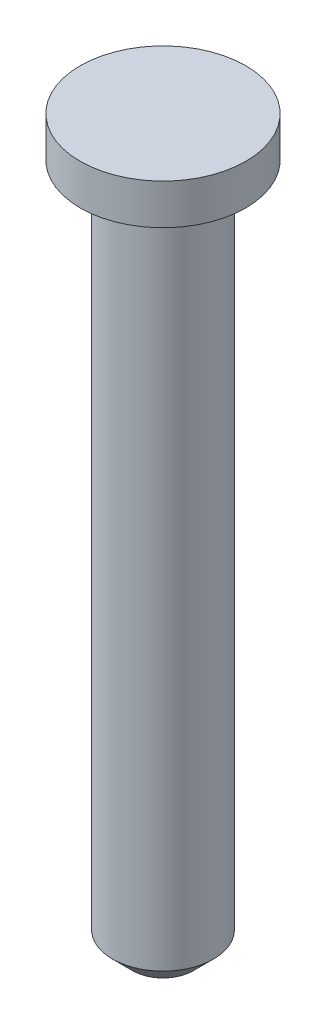
ISO-10303-21;
HEADER;
FILE_DESCRIPTION(('STEP AP214'),'2;1');
FILE_NAME('part.step','',(''),(''),'','','');
FILE_SCHEMA(('AUTOMOTIVE_DESIGN { 1 0 10303 214 1 1 1 1 }'));
ENDSEC;
DATA;
#1=APPLICATION_CONTEXT('core data for automotive mechanical design processes');
#2=APPLICATION_PROTOCOL_DEFINITION('international standard','automotive_design',2000,#1);
#3=PRODUCT_CONTEXT('',#1,'mechanical');
#4=PRODUCT('Part','Part','',(#3));
#5=PRODUCT_RELATED_PRODUCT_CATEGORY('part','',(#4));
#6=PRODUCT_DEFINITION_FORMATION('','',#4);
#7=PRODUCT_DEFINITION_CONTEXT('part definition',#1,'design');
#8=PRODUCT_DEFINITION('design','',#6,#7);
#9=PRODUCT_DEFINITION_SHAPE('','',#8);
#10=(LENGTH_UNIT() NAMED_UNIT(*) SI_UNIT(.MILLI.,.METRE.));
#11=(NAMED_UNIT(*) PLANE_ANGLE_UNIT() SI_UNIT($,.RADIAN.));
#12=(NAMED_UNIT(*) SI_UNIT($,.STERADIAN.) SOLID_ANGLE_UNIT());
#13=UNCERTAINTY_MEASURE_WITH_UNIT(LENGTH_MEASURE(1.E-05),#10,'distance_accuracy_value','');
#14=(GEOMETRIC_REPRESENTATION_CONTEXT(3) GLOBAL_UNCERTAINTY_ASSIGNED_CONTEXT((#13)) GLOBAL_UNIT_ASSIGNED_CONTEXT((#10,
#11,#12)) REPRESENTATION_CONTEXT('',''));
#15=CARTESIAN_POINT('',(0.,0.,0.));
#16=DIRECTION('',(0.,0.,1.));
#17=DIRECTION('',(1.,0.,0.));
#18=AXIS2_PLACEMENT_3D('',#15,#16,#17);
#19=CARTESIAN_POINT('',(0.,0.,0.));
#20=DIRECTION('',(0.,-1.,0.));
#21=DIRECTION('',(0.,0.,-1.));
#22=AXIS2_PLACEMENT_3D('',#19,#20,#21);
#23=PLANE('',#22);
#24=CARTESIAN_POINT('',(0.,0.,0.));
#25=DIRECTION('',(0.,1.,0.));
#26=DIRECTION('',(0.,0.,1.));
#27=AXIS2_PLACEMENT_3D('',#24,#25,#26);
#28=CIRCLE('',#27,2.05);
#29=CARTESIAN_POINT('',(0.,0.,2.05));
#30=VERTEX_POINT('',#29);
#31=EDGE_CURVE('E41',#30,#30,#28,.T.);
#32=ORIENTED_EDGE('',*,*,#31,.T.);
#33=EDGE_LOOP('',(#32));
#34=FACE_BOUND('',#33,.T.);
#35=ADVANCED_FACE('F30',(#34),#23,.F.);
#36=CARTESIAN_POINT('',(0.,0.,0.));
#37=DIRECTION('',(0.,1.,0.));
#38=DIRECTION('',(0.,0.,1.));
#39=AXIS2_PLACEMENT_3D('',#36,#37,#38);
#40=CYLINDRICAL_SURFACE('',#39,2.05);
#41=ORIENTED_EDGE('',*,*,#31,.F.);
#42=EDGE_LOOP('',(#41));
#43=FACE_BOUND('',#42,.T.);
#44=CARTESIAN_POINT('',(0.,-1.,0.));
#45=DIRECTION('',(0.,1.,0.));
#46=DIRECTION('',(0.,0.,1.));
#47=AXIS2_PLACEMENT_3D('',#44,#45,#46);
#48=CIRCLE('',#47,2.05);
#49=CARTESIAN_POINT('',(0.,-1.,2.05));
#50=VERTEX_POINT('',#49);
#51=EDGE_CURVE('E45',#50,#50,#48,.T.);
#52=ORIENTED_EDGE('',*,*,#51,.T.);
#53=EDGE_LOOP('',(#52));
#54=FACE_BOUND('',#53,.T.);
#55=ADVANCED_FACE('F65',(#43,#54),#40,.T.);
#56=CARTESIAN_POINT('',(2.05,-1.,0.));
#57=DIRECTION('',(0.,1.,0.));
#58=DIRECTION('',(0.,0.,1.));
#59=AXIS2_PLACEMENT_3D('',#56,#57,#58);
#60=PLANE('',#59);
#61=ORIENTED_EDGE('',*,*,#51,.F.);
#62=EDGE_LOOP('',(#61));
#63=FACE_BOUND('',#62,.T.);
#64=CARTESIAN_POINT('',(0.,-1.,0.));
#65=DIRECTION('',(0.,1.,0.));
#66=DIRECTION('',(0.,0.,1.));
#67=AXIS2_PLACEMENT_3D('',#64,#65,#66);
#68=CIRCLE('',#67,1.25);
#69=CARTESIAN_POINT('',(0.,-1.,1.25));
#70=VERTEX_POINT('',#69);
#71=EDGE_CURVE('E50',#70,#70,#68,.T.);
#72=ORIENTED_EDGE('',*,*,#71,.T.);
#73=EDGE_LOOP('',(#72));
#74=FACE_BOUND('',#73,.T.);
#75=ADVANCED_FACE('F54',(#63,#74),#60,.F.);
#76=CARTESIAN_POINT('',(0.,0.,0.));
#77=DIRECTION('',(0.,1.,0.));
#78=DIRECTION('',(0.,0.,1.));
#79=AXIS2_PLACEMENT_3D('',#76,#77,#78);
#80=CYLINDRICAL_SURFACE('',#79,1.25);
#81=CARTESIAN_POINT('',(0.,-17.5,0.));
#82=DIRECTION('',(0.,1.,0.));
#83=DIRECTION('',(0.,0.,1.));
#84=AXIS2_PLACEMENT_3D('',#81,#82,#83);
#85=CIRCLE('',#84,1.25);
#86=CARTESIAN_POINT('',(0.,-17.5,1.25));
#87=VERTEX_POINT('',#86);
#88=EDGE_CURVE('E37',#87,#87,#85,.T.);
#89=ORIENTED_EDGE('',*,*,#88,.T.);
#90=EDGE_LOOP('',(#89));
#91=FACE_BOUND('',#90,.T.);
#92=ORIENTED_EDGE('',*,*,#71,.F.);
#93=EDGE_LOOP('',(#92));
#94=FACE_BOUND('',#93,.T.);
#95=ADVANCED_FACE('F56',(#91,#94),#80,.T.);
#96=CARTESIAN_POINT('',(1.25,-18.,0.));
#97=DIRECTION('',(0.,1.,0.));
#98=DIRECTION('',(0.,0.,1.));
#99=AXIS2_PLACEMENT_3D('',#96,#97,#98);
#100=PLANE('',#99);
#101=CARTESIAN_POINT('',(0.,-18.,0.));
#102=DIRECTION('',(0.,1.,0.));
#103=DIRECTION('',(0.,0.,1.));
#104=AXIS2_PLACEMENT_3D('',#101,#102,#103);
#105=CIRCLE('',#104,0.749999999999997);
#106=CARTESIAN_POINT('',(0.,-18.,0.749999999999997));
#107=VERTEX_POINT('',#106);
#108=EDGE_CURVE('E10',#107,#107,#105,.F.);
#109=ORIENTED_EDGE('',*,*,#108,.T.);
#110=EDGE_LOOP('',(#109));
#111=FACE_BOUND('',#110,.T.);
#112=ADVANCED_FACE('F58',(#111),#100,.F.);
#113=CARTESIAN_POINT('',(0.,-17.5,0.));
#114=DIRECTION('',(0.,1.,0.));
#115=DIRECTION('',(0.,0.,1.));
#116=AXIS2_PLACEMENT_3D('',#113,#114,#115);
#117=CONICAL_SURFACE('',#116,1.25,0.785398163397452);
#118=ORIENTED_EDGE('',*,*,#108,.F.);
#119=EDGE_LOOP('',(#118));
#120=FACE_BOUND('',#119,.T.);
#121=ORIENTED_EDGE('',*,*,#88,.F.);
#122=EDGE_LOOP('',(#121));
#123=FACE_BOUND('',#122,.T.);
#124=ADVANCED_FACE('F32',(#120,#123),#117,.T.);
#125=CLOSED_SHELL('',(#35,#55,#75,#95,#112,#124));
#126=MANIFOLD_SOLID_BREP('B2',#125);
#127=ADVANCED_BREP_SHAPE_REPRESENTATION('',(#18,#126),#14);
#128=SHAPE_DEFINITION_REPRESENTATION(#9,#127);
ENDSEC;
END-ISO-10303-21;
